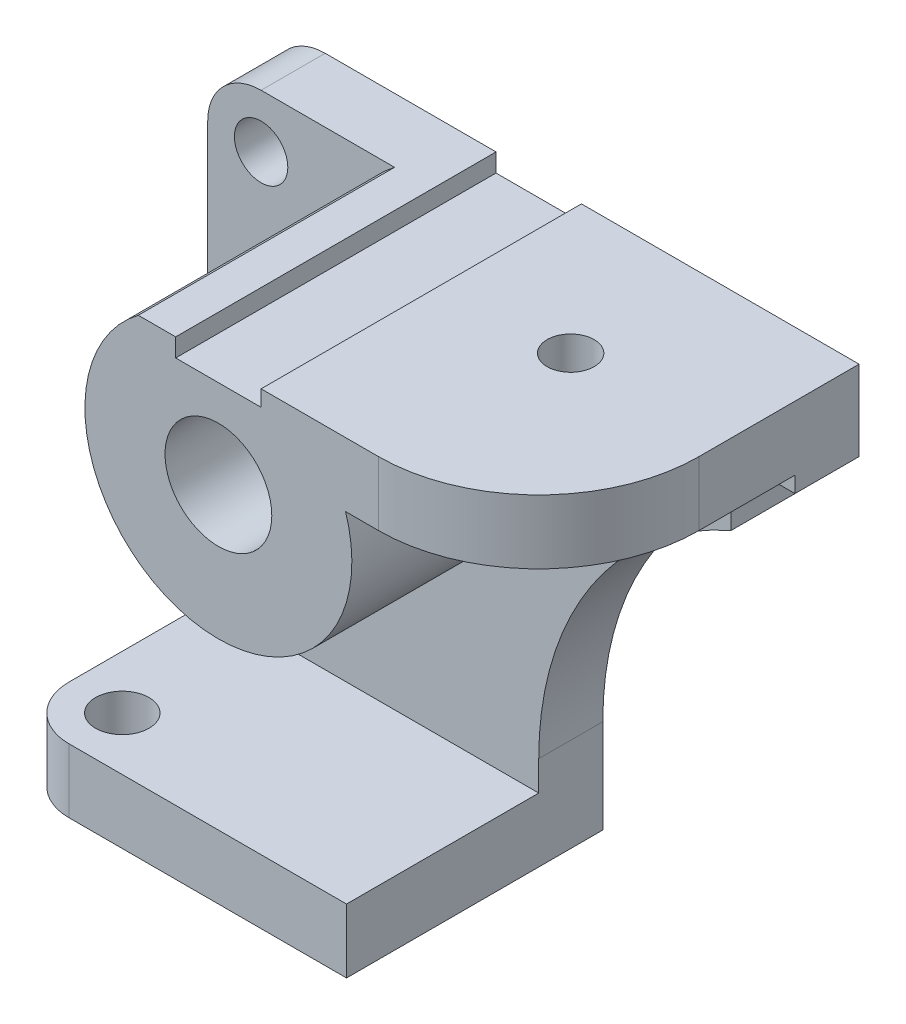
ISO-10303-21;
HEADER;
FILE_DESCRIPTION(('STEP AP214'),'2;1');
FILE_NAME('part.step','',(''),(''),'','','');
FILE_SCHEMA(('AUTOMOTIVE_DESIGN { 1 0 10303 214 1 1 1 1 }'));
ENDSEC;
DATA;
#1=APPLICATION_CONTEXT('core data for automotive mechanical design processes');
#2=APPLICATION_PROTOCOL_DEFINITION('international standard','automotive_design',2000,#1);
#3=PRODUCT_CONTEXT('',#1,'mechanical');
#4=PRODUCT('Part','Part','',(#3));
#5=PRODUCT_RELATED_PRODUCT_CATEGORY('part','',(#4));
#6=PRODUCT_DEFINITION_FORMATION('','',#4);
#7=PRODUCT_DEFINITION_CONTEXT('part definition',#1,'design');
#8=PRODUCT_DEFINITION('design','',#6,#7);
#9=PRODUCT_DEFINITION_SHAPE('','',#8);
#10=(LENGTH_UNIT() NAMED_UNIT(*) SI_UNIT(.MILLI.,.METRE.));
#11=(NAMED_UNIT(*) PLANE_ANGLE_UNIT() SI_UNIT($,.RADIAN.));
#12=(NAMED_UNIT(*) SI_UNIT($,.STERADIAN.) SOLID_ANGLE_UNIT());
#13=UNCERTAINTY_MEASURE_WITH_UNIT(LENGTH_MEASURE(1.E-05),#10,'distance_accuracy_value','');
#14=(GEOMETRIC_REPRESENTATION_CONTEXT(3) GLOBAL_UNCERTAINTY_ASSIGNED_CONTEXT((#13)) GLOBAL_UNIT_ASSIGNED_CONTEXT((#10,
#11,#12)) REPRESENTATION_CONTEXT('',''));
#15=CARTESIAN_POINT('',(0.,0.,0.));
#16=DIRECTION('',(0.,0.,1.));
#17=DIRECTION('',(1.,0.,0.));
#18=AXIS2_PLACEMENT_3D('',#15,#16,#17);
#19=CARTESIAN_POINT('',(-40.,90.,12.));
#20=DIRECTION('',(0.,0.,1.));
#21=DIRECTION('',(1.,0.,0.));
#22=AXIS2_PLACEMENT_3D('',#19,#20,#21);
#23=PLANE('',#22);
#24=DIRECTION('',(1.,0.,0.));
#25=VECTOR('',#24,1.);
#26=CARTESIAN_POINT('',(-40.,87.572444927403,12.));
#27=LINE('',#26,#25);
#28=CARTESIAN_POINT('',(23.825576127797,87.572444927403,12.));
#29=VERTEX_POINT('',#28);
#30=CARTESIAN_POINT('',(60.,87.572444927403,12.));
#31=VERTEX_POINT('',#30);
#32=EDGE_CURVE('E210',#29,#31,#27,.T.);
#33=ORIENTED_EDGE('',*,*,#32,.F.);
#34=CARTESIAN_POINT('',(0.,80.,12.));
#35=DIRECTION('',(0.,0.,1.));
#36=DIRECTION('',(1.,0.,0.));
#37=AXIS2_PLACEMENT_3D('',#34,#35,#36);
#38=CIRCLE('',#37,25.);
#39=CARTESIAN_POINT('',(-15.,100.,12.));
#40=VERTEX_POINT('',#39);
#41=EDGE_CURVE('E212',#40,#29,#38,.T.);
#42=ORIENTED_EDGE('',*,*,#41,.F.);
#43=DIRECTION('',(-1.,0.,0.));
#44=VECTOR('',#43,1.);
#45=CARTESIAN_POINT('',(-39.9999999999999,100.,12.));
#46=LINE('',#45,#44);
#47=CARTESIAN_POINT('',(-39.9999999999999,100.,12.));
#48=VERTEX_POINT('',#47);
#49=EDGE_CURVE('E288',#40,#48,#46,.T.);
#50=ORIENTED_EDGE('',*,*,#49,.T.);
#51=CARTESIAN_POINT('',(-40.,90.,12.));
#52=DIRECTION('',(0.,0.,1.));
#53=DIRECTION('',(1.,0.,0.));
#54=AXIS2_PLACEMENT_3D('',#51,#52,#53);
#55=CIRCLE('',#54,9.99999999999999);
#56=CARTESIAN_POINT('',(-50.,89.9999999999999,12.));
#57=VERTEX_POINT('',#56);
#58=EDGE_CURVE('E290',#48,#57,#55,.T.);
#59=ORIENTED_EDGE('',*,*,#58,.T.);
#60=DIRECTION('',(0.,-1.,0.));
#61=VECTOR('',#60,1.);
#62=CARTESIAN_POINT('',(-50.,0.,12.));
#63=LINE('',#62,#61);
#64=CARTESIAN_POINT('',(-50.,12.,12.));
#65=VERTEX_POINT('',#64);
#66=EDGE_CURVE('E60',#57,#65,#63,.T.);
#67=ORIENTED_EDGE('',*,*,#66,.T.);
#68=DIRECTION('',(1.,0.,0.));
#69=VECTOR('',#68,1.);
#70=CARTESIAN_POINT('',(-40.,12.,12.));
#71=LINE('',#70,#69);
#72=CARTESIAN_POINT('',(12.,12.,12.));
#73=VERTEX_POINT('',#72);
#74=EDGE_CURVE('E55',#65,#73,#71,.T.);
#75=ORIENTED_EDGE('',*,*,#74,.T.);
#76=DIRECTION('',(0.,1.,0.));
#77=VECTOR('',#76,1.);
#78=CARTESIAN_POINT('',(12.,0.,12.));
#79=LINE('',#78,#77);
#80=CARTESIAN_POINT('',(12.,17.5815365879329,12.));
#81=VERTEX_POINT('',#80);
#82=EDGE_CURVE('E276',#73,#81,#79,.T.);
#83=ORIENTED_EDGE('',*,*,#82,.T.);
#84=CARTESIAN_POINT('',(72.,17.5815365879329,12.));
#85=DIRECTION('',(0.,0.,-1.));
#86=DIRECTION('',(-1.,0.,0.));
#87=AXIS2_PLACEMENT_3D('',#84,#85,#86);
#88=CIRCLE('',#87,60.);
#89=CARTESIAN_POINT('',(48.,72.572444927403,12.));
#90=VERTEX_POINT('',#89);
#91=EDGE_CURVE('E278',#81,#90,#88,.T.);
#92=ORIENTED_EDGE('',*,*,#91,.T.);
#93=DIRECTION('',(0.,1.,0.));
#94=VECTOR('',#93,1.);
#95=CARTESIAN_POINT('',(48.,84.572444927403,12.));
#96=LINE('',#95,#94);
#97=CARTESIAN_POINT('',(48.,84.572444927403,12.));
#98=VERTEX_POINT('',#97);
#99=EDGE_CURVE('E281',#90,#98,#96,.T.);
#100=ORIENTED_EDGE('',*,*,#99,.T.);
#101=DIRECTION('',(1.,0.,0.));
#102=VECTOR('',#101,1.);
#103=CARTESIAN_POINT('',(60.,84.572444927403,12.));
#104=LINE('',#103,#102);
#105=CARTESIAN_POINT('',(60.,84.572444927403,12.));
#106=VERTEX_POINT('',#105);
#107=EDGE_CURVE('E283',#98,#106,#104,.T.);
#108=ORIENTED_EDGE('',*,*,#107,.T.);
#109=DIRECTION('',(0.,1.,0.));
#110=VECTOR('',#109,1.);
#111=CARTESIAN_POINT('',(60.,99.572444927403,12.));
#112=LINE('',#111,#110);
#113=EDGE_CURVE('E285',#106,#31,#112,.T.);
#114=ORIENTED_EDGE('',*,*,#113,.T.);
#115=EDGE_LOOP('',(#33,#42,#50,#59,#67,#75,#83,#92,#100,#108,#114));
#116=FACE_BOUND('',#115,.T.);
#117=CARTESIAN_POINT('',(-40.,90.,12.));
#118=DIRECTION('',(0.,0.,1.));
#119=DIRECTION('',(1.,0.,0.));
#120=AXIS2_PLACEMENT_3D('',#117,#118,#119);
#121=CIRCLE('',#120,5.);
#122=CARTESIAN_POINT('',(-35.,90.,12.));
#123=VERTEX_POINT('',#122);
#124=EDGE_CURVE('E270',#123,#123,#121,.T.);
#125=ORIENTED_EDGE('',*,*,#124,.F.);
#126=EDGE_LOOP('',(#125));
#127=FACE_BOUND('',#126,.T.);
#128=ADVANCED_FACE('F39',(#116,#127),#23,.T.);
#129=CARTESIAN_POINT('',(-40.,90.,0.));
#130=DIRECTION('',(0.,0.,1.));
#131=DIRECTION('',(1.,0.,0.));
#132=AXIS2_PLACEMENT_3D('',#129,#130,#131);
#133=PLANE('',#132);
#134=DIRECTION('',(-1.,0.,0.));
#135=VECTOR('',#134,1.);
#136=CARTESIAN_POINT('',(-8.,96.572444927403,0.));
#137=LINE('',#136,#135);
#138=CARTESIAN_POINT('',(8.,96.572444927403,0.));
#139=VERTEX_POINT('',#138);
#140=CARTESIAN_POINT('',(-8.,96.572444927403,0.));
#141=VERTEX_POINT('',#140);
#142=EDGE_CURVE('E307',#139,#141,#137,.T.);
#143=ORIENTED_EDGE('',*,*,#142,.F.);
#144=DIRECTION('',(0.,-1.,0.));
#145=VECTOR('',#144,1.);
#146=CARTESIAN_POINT('',(8.,96.572444927403,0.));
#147=LINE('',#146,#145);
#148=CARTESIAN_POINT('',(8.,99.572444927403,0.));
#149=VERTEX_POINT('',#148);
#150=EDGE_CURVE('E305',#149,#139,#147,.T.);
#151=ORIENTED_EDGE('',*,*,#150,.F.);
#152=DIRECTION('',(-1.,0.,0.));
#153=VECTOR('',#152,1.);
#154=CARTESIAN_POINT('',(8.,99.572444927403,0.));
#155=LINE('',#154,#153);
#156=CARTESIAN_POINT('',(60.,99.572444927403,0.));
#157=VERTEX_POINT('',#156);
#158=EDGE_CURVE('E303',#157,#149,#155,.T.);
#159=ORIENTED_EDGE('',*,*,#158,.F.);
#160=DIRECTION('',(0.,1.,0.));
#161=VECTOR('',#160,1.);
#162=CARTESIAN_POINT('',(60.,99.572444927403,0.));
#163=LINE('',#162,#161);
#164=CARTESIAN_POINT('',(60.,84.572444927403,0.));
#165=VERTEX_POINT('',#164);
#166=EDGE_CURVE('E301',#165,#157,#163,.T.);
#167=ORIENTED_EDGE('',*,*,#166,.F.);
#168=DIRECTION('',(1.,0.,0.));
#169=VECTOR('',#168,1.);
#170=CARTESIAN_POINT('',(60.,84.572444927403,0.));
#171=LINE('',#170,#169);
#172=CARTESIAN_POINT('',(48.,84.572444927403,0.));
#173=VERTEX_POINT('',#172);
#174=EDGE_CURVE('E299',#173,#165,#171,.T.);
#175=ORIENTED_EDGE('',*,*,#174,.F.);
#176=DIRECTION('',(0.,1.,0.));
#177=VECTOR('',#176,1.);
#178=CARTESIAN_POINT('',(48.,84.572444927403,0.));
#179=LINE('',#178,#177);
#180=CARTESIAN_POINT('',(48.,72.572444927403,0.));
#181=VERTEX_POINT('',#180);
#182=EDGE_CURVE('E297',#181,#173,#179,.T.);
#183=ORIENTED_EDGE('',*,*,#182,.F.);
#184=CARTESIAN_POINT('',(72.,17.5815365879329,0.));
#185=DIRECTION('',(0.,0.,-1.));
#186=DIRECTION('',(-1.,0.,0.));
#187=AXIS2_PLACEMENT_3D('',#184,#185,#186);
#188=CIRCLE('',#187,60.);
#189=CARTESIAN_POINT('',(12.,17.5815365879329,0.));
#190=VERTEX_POINT('',#189);
#191=EDGE_CURVE('E295',#190,#181,#188,.T.);
#192=ORIENTED_EDGE('',*,*,#191,.F.);
#193=DIRECTION('',(0.,1.,0.));
#194=VECTOR('',#193,1.);
#195=CARTESIAN_POINT('',(12.,0.,0.));
#196=LINE('',#195,#194);
#197=CARTESIAN_POINT('',(12.,0.,0.));
#198=VERTEX_POINT('',#197);
#199=EDGE_CURVE('E273',#198,#190,#196,.T.);
#200=ORIENTED_EDGE('',*,*,#199,.F.);
#201=DIRECTION('',(1.,0.,0.));
#202=VECTOR('',#201,1.);
#203=CARTESIAN_POINT('',(0.,0.,0.));
#204=LINE('',#203,#202);
#205=CARTESIAN_POINT('',(-50.,0.,0.));
#206=VERTEX_POINT('',#205);
#207=EDGE_CURVE('E279',#206,#198,#204,.T.);
#208=ORIENTED_EDGE('',*,*,#207,.F.);
#209=DIRECTION('',(0.,-1.,0.));
#210=VECTOR('',#209,1.);
#211=CARTESIAN_POINT('',(-50.,0.,0.));
#212=LINE('',#211,#210);
#213=CARTESIAN_POINT('',(-50.,89.9999999999999,0.));
#214=VERTEX_POINT('',#213);
#215=EDGE_CURVE('E315',#214,#206,#212,.T.);
#216=ORIENTED_EDGE('',*,*,#215,.F.);
#217=CARTESIAN_POINT('',(-40.,90.,0.));
#218=DIRECTION('',(0.,0.,1.));
#219=DIRECTION('',(1.,0.,0.));
#220=AXIS2_PLACEMENT_3D('',#217,#218,#219);
#221=CIRCLE('',#220,9.99999999999999);
#222=CARTESIAN_POINT('',(-39.9999999999999,100.,0.));
#223=VERTEX_POINT('',#222);
#224=EDGE_CURVE('E313',#223,#214,#221,.T.);
#225=ORIENTED_EDGE('',*,*,#224,.F.);
#226=DIRECTION('',(-1.,0.,0.));
#227=VECTOR('',#226,1.);
#228=CARTESIAN_POINT('',(-39.9999999999999,100.,0.));
#229=LINE('',#228,#227);
#230=CARTESIAN_POINT('',(-8.,100.,0.));
#231=VERTEX_POINT('',#230);
#232=EDGE_CURVE('E311',#231,#223,#229,.T.);
#233=ORIENTED_EDGE('',*,*,#232,.F.);
#234=DIRECTION('',(0.,1.,0.));
#235=VECTOR('',#234,1.);
#236=CARTESIAN_POINT('',(-8.,100.,0.));
#237=LINE('',#236,#235);
#238=EDGE_CURVE('E309',#141,#231,#237,.T.);
#239=ORIENTED_EDGE('',*,*,#238,.F.);
#240=EDGE_LOOP('',(#143,#151,#159,#167,#175,#183,#192,#200,#208,#216,#225,#233,#239));
#241=FACE_BOUND('',#240,.T.);
#242=CARTESIAN_POINT('',(0.,80.,0.));
#243=DIRECTION('',(0.,0.,1.));
#244=DIRECTION('',(1.,0.,0.));
#245=AXIS2_PLACEMENT_3D('',#242,#243,#244);
#246=CIRCLE('',#245,10.);
#247=CARTESIAN_POINT('',(10.,80.,0.));
#248=VERTEX_POINT('',#247);
#249=EDGE_CURVE('E266',#248,#248,#246,.T.);
#250=ORIENTED_EDGE('',*,*,#249,.T.);
#251=EDGE_LOOP('',(#250));
#252=FACE_BOUND('',#251,.T.);
#253=CARTESIAN_POINT('',(-40.,90.,0.));
#254=DIRECTION('',(0.,0.,1.));
#255=DIRECTION('',(1.,0.,0.));
#256=AXIS2_PLACEMENT_3D('',#253,#254,#255);
#257=CIRCLE('',#256,5.);
#258=CARTESIAN_POINT('',(-35.,90.,0.));
#259=VERTEX_POINT('',#258);
#260=EDGE_CURVE('E269',#259,#259,#257,.T.);
#261=ORIENTED_EDGE('',*,*,#260,.T.);
#262=EDGE_LOOP('',(#261));
#263=FACE_BOUND('',#262,.T.);
#264=ADVANCED_FACE('F362',(#241,#252,#263),#133,.F.);
#265=CARTESIAN_POINT('',(12.,0.,12.));
#266=DIRECTION('',(-1.,0.,0.));
#267=DIRECTION('',(0.,-1.,0.));
#268=AXIS2_PLACEMENT_3D('',#265,#266,#267);
#269=PLANE('',#268);
#270=ORIENTED_EDGE('',*,*,#199,.T.);
#271=DIRECTION('',(0.,0.,-1.));
#272=VECTOR('',#271,1.);
#273=CARTESIAN_POINT('',(12.,17.5815365879329,12.));
#274=LINE('',#273,#272);
#275=EDGE_CURVE('E48',#81,#190,#274,.T.);
#276=ORIENTED_EDGE('',*,*,#275,.F.);
#277=ORIENTED_EDGE('',*,*,#82,.F.);
#278=DIRECTION('',(0.,0.,1.));
#279=VECTOR('',#278,1.);
#280=CARTESIAN_POINT('',(12.,12.,48.));
#281=LINE('',#280,#279);
#282=CARTESIAN_POINT('',(12.,12.,48.));
#283=VERTEX_POINT('',#282);
#284=EDGE_CURVE('E241',#73,#283,#281,.T.);
#285=ORIENTED_EDGE('',*,*,#284,.T.);
#286=DIRECTION('',(0.,-1.,0.));
#287=VECTOR('',#286,1.);
#288=CARTESIAN_POINT('',(12.,12.,48.));
#289=LINE('',#288,#287);
#290=CARTESIAN_POINT('',(12.,0.,48.));
#291=VERTEX_POINT('',#290);
#292=EDGE_CURVE('E253',#283,#291,#289,.T.);
#293=ORIENTED_EDGE('',*,*,#292,.T.);
#294=DIRECTION('',(0.,0.,-1.));
#295=VECTOR('',#294,1.);
#296=CARTESIAN_POINT('',(12.,0.,12.));
#297=LINE('',#296,#295);
#298=EDGE_CURVE('E11',#291,#198,#297,.T.);
#299=ORIENTED_EDGE('',*,*,#298,.T.);
#300=EDGE_LOOP('',(#270,#276,#277,#285,#293,#299));
#301=FACE_BOUND('',#300,.T.);
#302=ADVANCED_FACE('F41',(#301),#269,.F.);
#303=CARTESIAN_POINT('',(72.,17.5815365879329,12.));
#304=DIRECTION('',(0.,0.,-1.));
#305=DIRECTION('',(-1.,0.,0.));
#306=AXIS2_PLACEMENT_3D('',#303,#304,#305);
#307=CYLINDRICAL_SURFACE('',#306,60.);
#308=ORIENTED_EDGE('',*,*,#191,.T.);
#309=DIRECTION('',(0.,0.,-1.));
#310=VECTOR('',#309,1.);
#311=CARTESIAN_POINT('',(48.,72.572444927403,12.));
#312=LINE('',#311,#310);
#313=EDGE_CURVE('E347',#90,#181,#312,.T.);
#314=ORIENTED_EDGE('',*,*,#313,.F.);
#315=ORIENTED_EDGE('',*,*,#91,.F.);
#316=ORIENTED_EDGE('',*,*,#275,.T.);
#317=EDGE_LOOP('',(#308,#314,#315,#316));
#318=FACE_BOUND('',#317,.T.);
#319=ADVANCED_FACE('F355',(#318),#307,.F.);
#320=CARTESIAN_POINT('',(48.,84.572444927403,12.));
#321=DIRECTION('',(-1.,0.,0.));
#322=DIRECTION('',(0.,0.,1.));
#323=AXIS2_PLACEMENT_3D('',#320,#321,#322);
#324=PLANE('',#323);
#325=ORIENTED_EDGE('',*,*,#182,.T.);
#326=DIRECTION('',(0.,0.,-1.));
#327=VECTOR('',#326,1.);
#328=CARTESIAN_POINT('',(48.,84.572444927403,12.));
#329=LINE('',#328,#327);
#330=EDGE_CURVE('E344',#98,#173,#329,.T.);
#331=ORIENTED_EDGE('',*,*,#330,.F.);
#332=ORIENTED_EDGE('',*,*,#99,.F.);
#333=ORIENTED_EDGE('',*,*,#313,.T.);
#334=EDGE_LOOP('',(#325,#331,#332,#333));
#335=FACE_BOUND('',#334,.T.);
#336=ADVANCED_FACE('F369',(#335),#324,.F.);
#337=CARTESIAN_POINT('',(60.,84.572444927403,12.));
#338=DIRECTION('',(0.,1.,0.));
#339=DIRECTION('',(0.,0.,1.));
#340=AXIS2_PLACEMENT_3D('',#337,#338,#339);
#341=PLANE('',#340);
#342=ORIENTED_EDGE('',*,*,#174,.T.);
#343=DIRECTION('',(0.,0.,-1.));
#344=VECTOR('',#343,1.);
#345=CARTESIAN_POINT('',(60.,84.572444927403,12.));
#346=LINE('',#345,#344);
#347=EDGE_CURVE('E341',#106,#165,#346,.T.);
#348=ORIENTED_EDGE('',*,*,#347,.F.);
#349=ORIENTED_EDGE('',*,*,#107,.F.);
#350=ORIENTED_EDGE('',*,*,#330,.T.);
#351=EDGE_LOOP('',(#342,#348,#349,#350));
#352=FACE_BOUND('',#351,.T.);
#353=ADVANCED_FACE('F373',(#352),#341,.F.);
#354=CARTESIAN_POINT('',(60.,99.572444927403,12.));
#355=DIRECTION('',(-1.,0.,0.));
#356=DIRECTION('',(0.,0.,1.));
#357=AXIS2_PLACEMENT_3D('',#354,#355,#356);
#358=PLANE('',#357);
#359=ORIENTED_EDGE('',*,*,#166,.T.);
#360=DIRECTION('',(0.,0.,-1.));
#361=VECTOR('',#360,1.);
#362=CARTESIAN_POINT('',(60.,99.572444927403,12.));
#363=LINE('',#362,#361);
#364=CARTESIAN_POINT('',(60.,99.572444927403,30.));
#365=VERTEX_POINT('',#364);
#366=EDGE_CURVE('E338',#365,#157,#363,.T.);
#367=ORIENTED_EDGE('',*,*,#366,.F.);
#368=DIRECTION('',(0.,1.,0.));
#369=VECTOR('',#368,1.);
#370=CARTESIAN_POINT('',(60.,87.572444927403,30.));
#371=LINE('',#370,#369);
#372=CARTESIAN_POINT('',(60.,87.572444927403,30.));
#373=VERTEX_POINT('',#372);
#374=EDGE_CURVE('E196',#373,#365,#371,.T.);
#375=ORIENTED_EDGE('',*,*,#374,.F.);
#376=DIRECTION('',(0.,0.,-1.));
#377=VECTOR('',#376,1.);
#378=CARTESIAN_POINT('',(60.,87.572444927403,12.));
#379=LINE('',#378,#377);
#380=EDGE_CURVE('E197',#373,#31,#379,.T.);
#381=ORIENTED_EDGE('',*,*,#380,.T.);
#382=ORIENTED_EDGE('',*,*,#113,.F.);
#383=ORIENTED_EDGE('',*,*,#347,.T.);
#384=EDGE_LOOP('',(#359,#367,#375,#381,#382,#383));
#385=FACE_BOUND('',#384,.T.);
#386=ADVANCED_FACE('F423',(#385),#358,.F.);
#387=CARTESIAN_POINT('',(8.,99.572444927403,12.));
#388=DIRECTION('',(0.,-1.,0.));
#389=DIRECTION('',(0.,0.,-1.));
#390=AXIS2_PLACEMENT_3D('',#387,#388,#389);
#391=PLANE('',#390);
#392=CARTESIAN_POINT('',(31.2020703305594,99.572444927403,25.2245627215284));
#393=DIRECTION('',(0.,1.,0.));
#394=DIRECTION('',(0.,0.,1.));
#395=AXIS2_PLACEMENT_3D('',#392,#393,#394);
#396=CIRCLE('',#395,4.4);
#397=CARTESIAN_POINT('',(31.2020703305594,99.572444927403,29.6245627215284));
#398=VERTEX_POINT('',#397);
#399=EDGE_CURVE('E709',#398,#398,#396,.T.);
#400=ORIENTED_EDGE('',*,*,#399,.F.);
#401=EDGE_LOOP('',(#400));
#402=FACE_BOUND('',#401,.T.);
#403=ORIENTED_EDGE('',*,*,#158,.T.);
#404=DIRECTION('',(0.,0.,-1.));
#405=VECTOR('',#404,1.);
#406=CARTESIAN_POINT('',(8.,99.572444927403,12.));
#407=LINE('',#406,#405);
#408=CARTESIAN_POINT('',(8.,99.572444927403,60.));
#409=VERTEX_POINT('',#408);
#410=EDGE_CURVE('E335',#409,#149,#407,.T.);
#411=ORIENTED_EDGE('',*,*,#410,.F.);
#412=DIRECTION('',(-1.,0.,0.));
#413=VECTOR('',#412,1.);
#414=CARTESIAN_POINT('',(0.,99.572444927403,60.));
#415=LINE('',#414,#413);
#416=CARTESIAN_POINT('',(30.,99.572444927403,60.));
#417=VERTEX_POINT('',#416);
#418=EDGE_CURVE('E219',#417,#409,#415,.T.);
#419=ORIENTED_EDGE('',*,*,#418,.F.);
#420=CARTESIAN_POINT('',(30.,99.572444927403,30.));
#421=DIRECTION('',(0.,1.,0.));
#422=DIRECTION('',(0.,0.,-1.));
#423=AXIS2_PLACEMENT_3D('',#420,#421,#422);
#424=CIRCLE('',#423,30.);
#425=EDGE_CURVE('E189',#417,#365,#424,.T.);
#426=ORIENTED_EDGE('',*,*,#425,.T.);
#427=ORIENTED_EDGE('',*,*,#366,.T.);
#428=EDGE_LOOP('',(#403,#411,#419,#426,#427));
#429=FACE_BOUND('',#428,.T.);
#430=ADVANCED_FACE('F421',(#402,#429),#391,.F.);
#431=CARTESIAN_POINT('',(8.,96.572444927403,12.));
#432=DIRECTION('',(1.,0.,0.));
#433=DIRECTION('',(0.,0.,-1.));
#434=AXIS2_PLACEMENT_3D('',#431,#432,#433);
#435=PLANE('',#434);
#436=ORIENTED_EDGE('',*,*,#150,.T.);
#437=DIRECTION('',(0.,0.,-1.));
#438=VECTOR('',#437,1.);
#439=CARTESIAN_POINT('',(8.,96.572444927403,12.));
#440=LINE('',#439,#438);
#441=CARTESIAN_POINT('',(8.,96.572444927403,60.));
#442=VERTEX_POINT('',#441);
#443=EDGE_CURVE('E332',#442,#139,#440,.T.);
#444=ORIENTED_EDGE('',*,*,#443,.F.);
#445=DIRECTION('',(0.,-1.,0.));
#446=VECTOR('',#445,1.);
#447=CARTESIAN_POINT('',(8.,0.,60.));
#448=LINE('',#447,#446);
#449=EDGE_CURVE('E221',#409,#442,#448,.T.);
#450=ORIENTED_EDGE('',*,*,#449,.F.);
#451=ORIENTED_EDGE('',*,*,#410,.T.);
#452=EDGE_LOOP('',(#436,#444,#450,#451));
#453=FACE_BOUND('',#452,.T.);
#454=ADVANCED_FACE('F418',(#453),#435,.F.);
#455=CARTESIAN_POINT('',(-8.,96.572444927403,12.));
#456=DIRECTION('',(0.,-1.,0.));
#457=DIRECTION('',(0.,0.,-1.));
#458=AXIS2_PLACEMENT_3D('',#455,#456,#457);
#459=PLANE('',#458);
#460=ORIENTED_EDGE('',*,*,#142,.T.);
#461=DIRECTION('',(0.,0.,-1.));
#462=VECTOR('',#461,1.);
#463=CARTESIAN_POINT('',(-8.,96.572444927403,12.));
#464=LINE('',#463,#462);
#465=CARTESIAN_POINT('',(-8.,96.572444927403,60.));
#466=VERTEX_POINT('',#465);
#467=EDGE_CURVE('E329',#466,#141,#464,.T.);
#468=ORIENTED_EDGE('',*,*,#467,.F.);
#469=DIRECTION('',(-1.,0.,0.));
#470=VECTOR('',#469,1.);
#471=CARTESIAN_POINT('',(0.,96.572444927403,60.));
#472=LINE('',#471,#470);
#473=EDGE_CURVE('E223',#442,#466,#472,.T.);
#474=ORIENTED_EDGE('',*,*,#473,.F.);
#475=ORIENTED_EDGE('',*,*,#443,.T.);
#476=EDGE_LOOP('',(#460,#468,#474,#475));
#477=FACE_BOUND('',#476,.T.);
#478=ADVANCED_FACE('F415',(#477),#459,.F.);
#479=CARTESIAN_POINT('',(-8.,100.,12.));
#480=DIRECTION('',(-1.,0.,0.));
#481=DIRECTION('',(0.,-1.,0.));
#482=AXIS2_PLACEMENT_3D('',#479,#480,#481);
#483=PLANE('',#482);
#484=ORIENTED_EDGE('',*,*,#238,.T.);
#485=DIRECTION('',(0.,0.,-1.));
#486=VECTOR('',#485,1.);
#487=CARTESIAN_POINT('',(-8.,100.,12.));
#488=LINE('',#487,#486);
#489=CARTESIAN_POINT('',(-8.,100.,60.));
#490=VERTEX_POINT('',#489);
#491=EDGE_CURVE('E326',#490,#231,#488,.T.);
#492=ORIENTED_EDGE('',*,*,#491,.F.);
#493=DIRECTION('',(0.,1.,0.));
#494=VECTOR('',#493,1.);
#495=CARTESIAN_POINT('',(-8.00000000000005,0.,60.));
#496=LINE('',#495,#494);
#497=EDGE_CURVE('E226',#466,#490,#496,.T.);
#498=ORIENTED_EDGE('',*,*,#497,.F.);
#499=ORIENTED_EDGE('',*,*,#467,.T.);
#500=EDGE_LOOP('',(#484,#492,#498,#499));
#501=FACE_BOUND('',#500,.T.);
#502=ADVANCED_FACE('F411',(#501),#483,.F.);
#503=CARTESIAN_POINT('',(-39.9999999999999,100.,12.));
#504=DIRECTION('',(0.,-1.,0.));
#505=DIRECTION('',(0.,0.,-1.));
#506=AXIS2_PLACEMENT_3D('',#503,#504,#505);
#507=PLANE('',#506);
#508=ORIENTED_EDGE('',*,*,#232,.T.);
#509=DIRECTION('',(0.,0.,-1.));
#510=VECTOR('',#509,1.);
#511=CARTESIAN_POINT('',(-39.9999999999999,100.,12.));
#512=LINE('',#511,#510);
#513=EDGE_CURVE('E323',#48,#223,#512,.T.);
#514=ORIENTED_EDGE('',*,*,#513,.F.);
#515=ORIENTED_EDGE('',*,*,#49,.F.);
#516=DIRECTION('',(0.,0.,-1.));
#517=VECTOR('',#516,1.);
#518=CARTESIAN_POINT('',(-15.,100.,60.));
#519=LINE('',#518,#517);
#520=CARTESIAN_POINT('',(-15.,100.,60.));
#521=VERTEX_POINT('',#520);
#522=EDGE_CURVE('E229',#521,#40,#519,.T.);
#523=ORIENTED_EDGE('',*,*,#522,.F.);
#524=DIRECTION('',(-1.,0.,0.));
#525=VECTOR('',#524,1.);
#526=CARTESIAN_POINT('',(0.,100.,60.));
#527=LINE('',#526,#525);
#528=EDGE_CURVE('E216',#490,#521,#527,.T.);
#529=ORIENTED_EDGE('',*,*,#528,.F.);
#530=ORIENTED_EDGE('',*,*,#491,.T.);
#531=EDGE_LOOP('',(#508,#514,#515,#523,#529,#530));
#532=FACE_BOUND('',#531,.T.);
#533=ADVANCED_FACE('F404',(#532),#507,.F.);
#534=CARTESIAN_POINT('',(-40.,90.,12.));
#535=DIRECTION('',(0.,0.,-1.));
#536=DIRECTION('',(-1.,0.,0.));
#537=AXIS2_PLACEMENT_3D('',#534,#535,#536);
#538=CYLINDRICAL_SURFACE('',#537,9.99999999999999);
#539=ORIENTED_EDGE('',*,*,#224,.T.);
#540=DIRECTION('',(0.,0.,-1.));
#541=VECTOR('',#540,1.);
#542=CARTESIAN_POINT('',(-50.,89.9999999999999,12.));
#543=LINE('',#542,#541);
#544=EDGE_CURVE('E320',#57,#214,#543,.T.);
#545=ORIENTED_EDGE('',*,*,#544,.F.);
#546=ORIENTED_EDGE('',*,*,#58,.F.);
#547=ORIENTED_EDGE('',*,*,#513,.T.);
#548=EDGE_LOOP('',(#539,#545,#546,#547));
#549=FACE_BOUND('',#548,.T.);
#550=ADVANCED_FACE('F401',(#549),#538,.T.);
#551=CARTESIAN_POINT('',(-50.,0.,12.));
#552=DIRECTION('',(1.,0.,0.));
#553=DIRECTION('',(0.,0.,-1.));
#554=AXIS2_PLACEMENT_3D('',#551,#552,#553);
#555=PLANE('',#554);
#556=DIRECTION('',(0.,0.,-1.));
#557=VECTOR('',#556,1.);
#558=CARTESIAN_POINT('',(-50.,0.,12.));
#559=LINE('',#558,#557);
#560=CARTESIAN_POINT('',(-50.,0.,37.9999999999999));
#561=VERTEX_POINT('',#560);
#562=EDGE_CURVE('E293',#561,#206,#559,.T.);
#563=ORIENTED_EDGE('',*,*,#562,.F.);
#564=DIRECTION('',(0.,-1.,0.));
#565=VECTOR('',#564,1.);
#566=CARTESIAN_POINT('',(-50.,12.,37.9999999999999));
#567=LINE('',#566,#565);
#568=CARTESIAN_POINT('',(-50.,12.,37.9999999999999));
#569=VERTEX_POINT('',#568);
#570=EDGE_CURVE('E258',#569,#561,#567,.T.);
#571=ORIENTED_EDGE('',*,*,#570,.F.);
#572=DIRECTION('',(0.,0.,-1.));
#573=VECTOR('',#572,1.);
#574=CARTESIAN_POINT('',(-50.,12.,0.));
#575=LINE('',#574,#573);
#576=EDGE_CURVE('E250',#569,#65,#575,.T.);
#577=ORIENTED_EDGE('',*,*,#576,.T.);
#578=ORIENTED_EDGE('',*,*,#66,.F.);
#579=ORIENTED_EDGE('',*,*,#544,.T.);
#580=ORIENTED_EDGE('',*,*,#215,.T.);
#581=EDGE_LOOP('',(#563,#571,#577,#578,#579,#580));
#582=FACE_BOUND('',#581,.T.);
#583=ADVANCED_FACE('F397',(#582),#555,.F.);
#584=CARTESIAN_POINT('',(0.,0.,12.));
#585=DIRECTION('',(0.,1.,0.));
#586=DIRECTION('',(0.,0.,1.));
#587=AXIS2_PLACEMENT_3D('',#584,#585,#586);
#588=PLANE('',#587);
#589=ORIENTED_EDGE('',*,*,#207,.T.);
#590=ORIENTED_EDGE('',*,*,#298,.F.);
#591=DIRECTION('',(-1.,0.,0.));
#592=VECTOR('',#591,1.);
#593=CARTESIAN_POINT('',(-39.9999999999999,0.,48.));
#594=LINE('',#593,#592);
#595=CARTESIAN_POINT('',(-39.9999999999999,0.,48.));
#596=VERTEX_POINT('',#595);
#597=EDGE_CURVE('E238',#291,#596,#594,.T.);
#598=ORIENTED_EDGE('',*,*,#597,.T.);
#599=CARTESIAN_POINT('',(-40.,0.,38.));
#600=DIRECTION('',(0.,-1.,0.));
#601=DIRECTION('',(0.,0.,-1.));
#602=AXIS2_PLACEMENT_3D('',#599,#600,#601);
#603=CIRCLE('',#602,9.99999999999999);
#604=EDGE_CURVE('E244',#596,#561,#603,.T.);
#605=ORIENTED_EDGE('',*,*,#604,.T.);
#606=ORIENTED_EDGE('',*,*,#562,.T.);
#607=EDGE_LOOP('',(#589,#590,#598,#605,#606));
#608=FACE_BOUND('',#607,.T.);
#609=CARTESIAN_POINT('',(-40.,0.,38.));
#610=DIRECTION('',(0.,-1.,0.));
#611=DIRECTION('',(0.,0.,-1.));
#612=AXIS2_PLACEMENT_3D('',#609,#610,#611);
#613=CIRCLE('',#612,5.);
#614=CARTESIAN_POINT('',(-40.,0.,33.));
#615=VERTEX_POINT('',#614);
#616=EDGE_CURVE('E234',#615,#615,#613,.T.);
#617=ORIENTED_EDGE('',*,*,#616,.F.);
#618=EDGE_LOOP('',(#617));
#619=FACE_BOUND('',#618,.T.);
#620=ADVANCED_FACE('F391',(#608,#619),#588,.F.);
#621=CARTESIAN_POINT('',(-40.,90.,12.));
#622=DIRECTION('',(0.,0.,-1.));
#623=DIRECTION('',(-1.,0.,0.));
#624=AXIS2_PLACEMENT_3D('',#621,#622,#623);
#625=CYLINDRICAL_SURFACE('',#624,5.);
#626=ORIENTED_EDGE('',*,*,#124,.T.);
#627=EDGE_LOOP('',(#626));
#628=FACE_BOUND('',#627,.T.);
#629=ORIENTED_EDGE('',*,*,#260,.F.);
#630=EDGE_LOOP('',(#629));
#631=FACE_BOUND('',#630,.T.);
#632=ADVANCED_FACE('F440',(#628,#631),#625,.F.);
#633=CARTESIAN_POINT('',(0.,80.,12.));
#634=DIRECTION('',(0.,0.,-1.));
#635=DIRECTION('',(-1.,0.,0.));
#636=AXIS2_PLACEMENT_3D('',#633,#634,#635);
#637=CYLINDRICAL_SURFACE('',#636,10.);
#638=ORIENTED_EDGE('',*,*,#249,.F.);
#639=EDGE_LOOP('',(#638));
#640=FACE_BOUND('',#639,.T.);
#641=CARTESIAN_POINT('',(0.,80.,60.));
#642=DIRECTION('',(0.,0.,1.));
#643=DIRECTION('',(1.,0.,0.));
#644=AXIS2_PLACEMENT_3D('',#641,#642,#643);
#645=CIRCLE('',#644,10.);
#646=CARTESIAN_POINT('',(10.,80.,60.));
#647=VERTEX_POINT('',#646);
#648=EDGE_CURVE('E213',#647,#647,#645,.F.);
#649=ORIENTED_EDGE('',*,*,#648,.F.);
#650=EDGE_LOOP('',(#649));
#651=FACE_BOUND('',#650,.T.);
#652=ADVANCED_FACE('F495',(#640,#651),#637,.F.);
#653=CARTESIAN_POINT('',(-40.,12.,38.));
#654=DIRECTION('',(0.,-1.,0.));
#655=DIRECTION('',(0.,0.,-1.));
#656=AXIS2_PLACEMENT_3D('',#653,#654,#655);
#657=CYLINDRICAL_SURFACE('',#656,9.99999999999999);
#658=ORIENTED_EDGE('',*,*,#604,.F.);
#659=DIRECTION('',(0.,-1.,0.));
#660=VECTOR('',#659,1.);
#661=CARTESIAN_POINT('',(-39.9999999999999,12.,48.));
#662=LINE('',#661,#660);
#663=CARTESIAN_POINT('',(-39.9999999999999,12.,48.));
#664=VERTEX_POINT('',#663);
#665=EDGE_CURVE('E261',#664,#596,#662,.T.);
#666=ORIENTED_EDGE('',*,*,#665,.F.);
#667=CARTESIAN_POINT('',(-40.,12.,38.));
#668=DIRECTION('',(0.,-1.,0.));
#669=DIRECTION('',(0.,0.,-1.));
#670=AXIS2_PLACEMENT_3D('',#667,#668,#669);
#671=CIRCLE('',#670,9.99999999999999);
#672=EDGE_CURVE('E247',#664,#569,#671,.T.);
#673=ORIENTED_EDGE('',*,*,#672,.T.);
#674=ORIENTED_EDGE('',*,*,#570,.T.);
#675=EDGE_LOOP('',(#658,#666,#673,#674));
#676=FACE_BOUND('',#675,.T.);
#677=ADVANCED_FACE('F501',(#676),#657,.T.);
#678=CARTESIAN_POINT('',(-39.9999999999999,12.,48.));
#679=DIRECTION('',(0.,0.,1.));
#680=DIRECTION('',(1.,0.,0.));
#681=AXIS2_PLACEMENT_3D('',#678,#679,#680);
#682=PLANE('',#681);
#683=ORIENTED_EDGE('',*,*,#597,.F.);
#684=ORIENTED_EDGE('',*,*,#292,.F.);
#685=DIRECTION('',(-1.,0.,0.));
#686=VECTOR('',#685,1.);
#687=CARTESIAN_POINT('',(-39.9999999999999,12.,48.));
#688=LINE('',#687,#686);
#689=EDGE_CURVE('E243',#283,#664,#688,.T.);
#690=ORIENTED_EDGE('',*,*,#689,.T.);
#691=ORIENTED_EDGE('',*,*,#665,.T.);
#692=EDGE_LOOP('',(#683,#684,#690,#691));
#693=FACE_BOUND('',#692,.T.);
#694=ADVANCED_FACE('F388',(#693),#682,.T.);
#695=CARTESIAN_POINT('',(-40.,12.,38.));
#696=DIRECTION('',(0.,-1.,0.));
#697=DIRECTION('',(0.,0.,-1.));
#698=AXIS2_PLACEMENT_3D('',#695,#696,#697);
#699=PLANE('',#698);
#700=ORIENTED_EDGE('',*,*,#74,.F.);
#701=ORIENTED_EDGE('',*,*,#576,.F.);
#702=ORIENTED_EDGE('',*,*,#672,.F.);
#703=ORIENTED_EDGE('',*,*,#689,.F.);
#704=ORIENTED_EDGE('',*,*,#284,.F.);
#705=EDGE_LOOP('',(#700,#701,#702,#703,#704));
#706=FACE_BOUND('',#705,.T.);
#707=CARTESIAN_POINT('',(-40.,12.,38.));
#708=DIRECTION('',(0.,-1.,0.));
#709=DIRECTION('',(0.,0.,-1.));
#710=AXIS2_PLACEMENT_3D('',#707,#708,#709);
#711=CIRCLE('',#710,5.);
#712=CARTESIAN_POINT('',(-40.,12.,33.));
#713=VERTEX_POINT('',#712);
#714=EDGE_CURVE('E235',#713,#713,#711,.T.);
#715=ORIENTED_EDGE('',*,*,#714,.T.);
#716=EDGE_LOOP('',(#715));
#717=FACE_BOUND('',#716,.T.);
#718=ADVANCED_FACE('F382',(#706,#717),#699,.F.);
#719=CARTESIAN_POINT('',(-40.,12.,38.));
#720=DIRECTION('',(0.,-1.,0.));
#721=DIRECTION('',(0.,0.,-1.));
#722=AXIS2_PLACEMENT_3D('',#719,#720,#721);
#723=CYLINDRICAL_SURFACE('',#722,5.);
#724=ORIENTED_EDGE('',*,*,#714,.F.);
#725=EDGE_LOOP('',(#724));
#726=FACE_BOUND('',#725,.T.);
#727=ORIENTED_EDGE('',*,*,#616,.T.);
#728=EDGE_LOOP('',(#727));
#729=FACE_BOUND('',#728,.T.);
#730=ADVANCED_FACE('F520',(#726,#729),#723,.F.);
#731=CARTESIAN_POINT('',(0.,80.,60.));
#732=DIRECTION('',(0.,0.,-1.));
#733=DIRECTION('',(-1.,0.,0.));
#734=AXIS2_PLACEMENT_3D('',#731,#732,#733);
#735=CYLINDRICAL_SURFACE('',#734,25.);
#736=ORIENTED_EDGE('',*,*,#41,.T.);
#737=DIRECTION('',(0.,0.,-1.));
#738=VECTOR('',#737,1.);
#739=CARTESIAN_POINT('',(23.825576127797,87.572444927403,60.));
#740=LINE('',#739,#738);
#741=CARTESIAN_POINT('',(23.825576127797,87.572444927403,60.));
#742=VERTEX_POINT('',#741);
#743=EDGE_CURVE('E207',#29,#742,#740,.F.);
#744=ORIENTED_EDGE('',*,*,#743,.T.);
#745=CARTESIAN_POINT('',(0.,80.,60.));
#746=DIRECTION('',(0.,0.,1.));
#747=DIRECTION('',(1.,0.,0.));
#748=AXIS2_PLACEMENT_3D('',#745,#746,#747);
#749=CIRCLE('',#748,25.);
#750=EDGE_CURVE('E184',#521,#742,#749,.T.);
#751=ORIENTED_EDGE('',*,*,#750,.F.);
#752=ORIENTED_EDGE('',*,*,#522,.T.);
#753=EDGE_LOOP('',(#736,#744,#751,#752));
#754=FACE_BOUND('',#753,.T.);
#755=ADVANCED_FACE('F526',(#754),#735,.T.);
#756=CARTESIAN_POINT('',(0.,0.,60.));
#757=DIRECTION('',(0.,0.,1.));
#758=DIRECTION('',(1.,0.,0.));
#759=AXIS2_PLACEMENT_3D('',#756,#757,#758);
#760=PLANE('',#759);
#761=ORIENTED_EDGE('',*,*,#449,.T.);
#762=ORIENTED_EDGE('',*,*,#473,.T.);
#763=ORIENTED_EDGE('',*,*,#497,.T.);
#764=ORIENTED_EDGE('',*,*,#528,.T.);
#765=ORIENTED_EDGE('',*,*,#750,.T.);
#766=DIRECTION('',(1.,0.,0.));
#767=VECTOR('',#766,1.);
#768=CARTESIAN_POINT('',(30.,87.572444927403,60.));
#769=LINE('',#768,#767);
#770=CARTESIAN_POINT('',(30.,87.572444927403,60.));
#771=VERTEX_POINT('',#770);
#772=EDGE_CURVE('E175',#742,#771,#769,.T.);
#773=ORIENTED_EDGE('',*,*,#772,.T.);
#774=DIRECTION('',(0.,1.,0.));
#775=VECTOR('',#774,1.);
#776=CARTESIAN_POINT('',(30.,87.572444927403,60.));
#777=LINE('',#776,#775);
#778=EDGE_CURVE('E181',#771,#417,#777,.T.);
#779=ORIENTED_EDGE('',*,*,#778,.T.);
#780=ORIENTED_EDGE('',*,*,#418,.T.);
#781=EDGE_LOOP('',(#761,#762,#763,#764,#765,#773,#779,#780));
#782=FACE_BOUND('',#781,.T.);
#783=ORIENTED_EDGE('',*,*,#648,.T.);
#784=EDGE_LOOP('',(#783));
#785=FACE_BOUND('',#784,.T.);
#786=ADVANCED_FACE('F178',(#782,#785),#760,.T.);
#787=CARTESIAN_POINT('',(30.,87.572444927403,30.));
#788=DIRECTION('',(0.,1.,0.));
#789=DIRECTION('',(0.,0.,1.));
#790=AXIS2_PLACEMENT_3D('',#787,#788,#789);
#791=CYLINDRICAL_SURFACE('',#790,30.);
#792=ORIENTED_EDGE('',*,*,#425,.F.);
#793=ORIENTED_EDGE('',*,*,#778,.F.);
#794=CARTESIAN_POINT('',(30.,87.572444927403,30.));
#795=DIRECTION('',(0.,1.,0.));
#796=DIRECTION('',(0.,0.,-1.));
#797=AXIS2_PLACEMENT_3D('',#794,#795,#796);
#798=CIRCLE('',#797,30.);
#799=EDGE_CURVE('E188',#771,#373,#798,.T.);
#800=ORIENTED_EDGE('',*,*,#799,.T.);
#801=ORIENTED_EDGE('',*,*,#374,.T.);
#802=EDGE_LOOP('',(#792,#793,#800,#801));
#803=FACE_BOUND('',#802,.T.);
#804=ADVANCED_FACE('F193',(#803),#791,.T.);
#805=CARTESIAN_POINT('',(30.,87.572444927403,30.));
#806=DIRECTION('',(0.,-1.,0.));
#807=DIRECTION('',(0.,0.,-1.));
#808=AXIS2_PLACEMENT_3D('',#805,#806,#807);
#809=PLANE('',#808);
#810=CARTESIAN_POINT('',(31.2020703305594,87.572444927403,25.2245627215284));
#811=DIRECTION('',(0.,-1.,0.));
#812=DIRECTION('',(0.,0.,-1.));
#813=AXIS2_PLACEMENT_3D('',#810,#811,#812);
#814=CIRCLE('',#813,4.4);
#815=CARTESIAN_POINT('',(31.2020703305594,87.572444927403,20.8245627215284));
#816=VERTEX_POINT('',#815);
#817=EDGE_CURVE('E43',#816,#816,#814,.T.);
#818=ORIENTED_EDGE('',*,*,#817,.F.);
#819=EDGE_LOOP('',(#818));
#820=FACE_BOUND('',#819,.T.);
#821=ORIENTED_EDGE('',*,*,#743,.F.);
#822=ORIENTED_EDGE('',*,*,#32,.T.);
#823=ORIENTED_EDGE('',*,*,#380,.F.);
#824=ORIENTED_EDGE('',*,*,#799,.F.);
#825=ORIENTED_EDGE('',*,*,#772,.F.);
#826=EDGE_LOOP('',(#821,#822,#823,#824,#825));
#827=FACE_BOUND('',#826,.T.);
#828=ADVANCED_FACE('F200',(#820,#827),#809,.T.);
#829=CARTESIAN_POINT('',(31.2020703305594,0.,25.2245627215284));
#830=DIRECTION('',(0.,1.,0.));
#831=DIRECTION('',(0.,0.,1.));
#832=AXIS2_PLACEMENT_3D('',#829,#830,#831);
#833=CYLINDRICAL_SURFACE('',#832,4.4);
#834=ORIENTED_EDGE('',*,*,#817,.T.);
#835=EDGE_LOOP('',(#834));
#836=FACE_BOUND('',#835,.T.);
#837=ORIENTED_EDGE('',*,*,#399,.T.);
#838=EDGE_LOOP('',(#837));
#839=FACE_BOUND('',#838,.T.);
#840=ADVANCED_FACE('F553',(#836,#839),#833,.F.);
#841=CLOSED_SHELL('',(#128,#264,#302,#319,#336,#353,#386,#430,#454,#478,#502,#533,#550,#583,
#620,#632,#652,#677,#694,#718,#730,#755,#786,#804,#828,#840));
#842=MANIFOLD_SOLID_BREP('B2',#841);
#843=ADVANCED_BREP_SHAPE_REPRESENTATION('',(#18,#842),#14);
#844=SHAPE_DEFINITION_REPRESENTATION(#9,#843);
ENDSEC;
END-ISO-10303-21;
